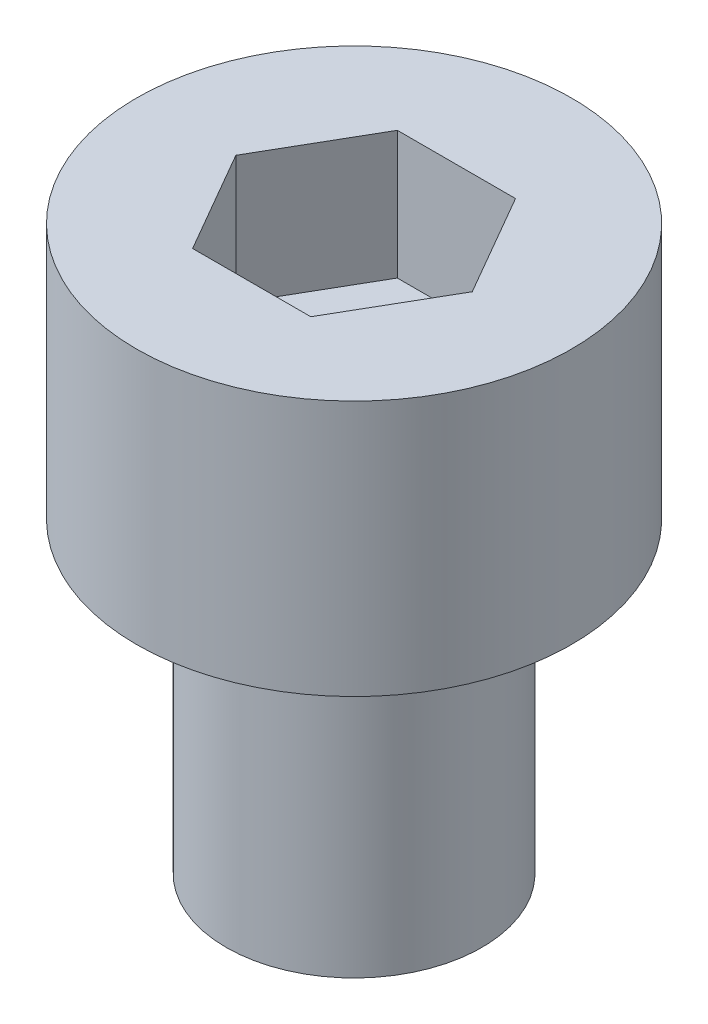
ISO-10303-21;
HEADER;
FILE_DESCRIPTION(('STEP AP214'),'2;1');
FILE_NAME('part.step','',(''),(''),'','','');
FILE_SCHEMA(('AUTOMOTIVE_DESIGN { 1 0 10303 214 1 1 1 1 }'));
ENDSEC;
DATA;
#1=APPLICATION_CONTEXT('core data for automotive mechanical design processes');
#2=APPLICATION_PROTOCOL_DEFINITION('international standard','automotive_design',2000,#1);
#3=PRODUCT_CONTEXT('',#1,'mechanical');
#4=PRODUCT('Part','Part','',(#3));
#5=PRODUCT_RELATED_PRODUCT_CATEGORY('part','',(#4));
#6=PRODUCT_DEFINITION_FORMATION('','',#4);
#7=PRODUCT_DEFINITION_CONTEXT('part definition',#1,'design');
#8=PRODUCT_DEFINITION('design','',#6,#7);
#9=PRODUCT_DEFINITION_SHAPE('','',#8);
#10=(LENGTH_UNIT() NAMED_UNIT(*) SI_UNIT(.MILLI.,.METRE.));
#11=(NAMED_UNIT(*) PLANE_ANGLE_UNIT() SI_UNIT($,.RADIAN.));
#12=(NAMED_UNIT(*) SI_UNIT($,.STERADIAN.) SOLID_ANGLE_UNIT());
#13=UNCERTAINTY_MEASURE_WITH_UNIT(LENGTH_MEASURE(1.E-05),#10,'distance_accuracy_value','');
#14=(GEOMETRIC_REPRESENTATION_CONTEXT(3) GLOBAL_UNCERTAINTY_ASSIGNED_CONTEXT((#13)) GLOBAL_UNIT_ASSIGNED_CONTEXT((#10,
#11,#12)) REPRESENTATION_CONTEXT('',''));
#15=CARTESIAN_POINT('',(0.,0.,0.));
#16=DIRECTION('',(0.,0.,1.));
#17=DIRECTION('',(1.,0.,0.));
#18=AXIS2_PLACEMENT_3D('',#15,#16,#17);
#19=CARTESIAN_POINT('',(0.,5.,0.));
#20=DIRECTION('',(0.,-1.,0.));
#21=DIRECTION('',(0.,0.,-1.));
#22=AXIS2_PLACEMENT_3D('',#19,#20,#21);
#23=CYLINDRICAL_SURFACE('',#22,4.25);
#24=CARTESIAN_POINT('',(0.,5.,0.));
#25=DIRECTION('',(0.,1.,0.));
#26=DIRECTION('',(0.,0.,1.));
#27=AXIS2_PLACEMENT_3D('',#24,#25,#26);
#28=CIRCLE('',#27,4.25);
#29=CARTESIAN_POINT('',(0.,5.,4.25));
#30=VERTEX_POINT('',#29);
#31=EDGE_CURVE('E43',#30,#30,#28,.T.);
#32=ORIENTED_EDGE('',*,*,#31,.F.);
#33=EDGE_LOOP('',(#32));
#34=FACE_BOUND('',#33,.T.);
#35=CARTESIAN_POINT('',(0.,0.,0.));
#36=DIRECTION('',(0.,1.,0.));
#37=DIRECTION('',(0.,0.,1.));
#38=AXIS2_PLACEMENT_3D('',#35,#36,#37);
#39=CIRCLE('',#38,4.25);
#40=CARTESIAN_POINT('',(0.,0.,4.25));
#41=VERTEX_POINT('',#40);
#42=EDGE_CURVE('E38',#41,#41,#39,.T.);
#43=ORIENTED_EDGE('',*,*,#42,.T.);
#44=EDGE_LOOP('',(#43));
#45=FACE_BOUND('',#44,.T.);
#46=ADVANCED_FACE('F35',(#34,#45),#23,.T.);
#47=CARTESIAN_POINT('',(0.,5.,0.));
#48=DIRECTION('',(0.,1.,0.));
#49=DIRECTION('',(0.,0.,1.));
#50=AXIS2_PLACEMENT_3D('',#47,#48,#49);
#51=PLANE('',#50);
#52=DIRECTION('',(0.5,0.,-0.866025403784439));
#53=VECTOR('',#52,1.);
#54=CARTESIAN_POINT('',(1.15470053837925,5.,2.));
#55=LINE('',#54,#53);
#56=CARTESIAN_POINT('',(1.15470053837925,5.,2.));
#57=VERTEX_POINT('',#56);
#58=CARTESIAN_POINT('',(2.3094010767585,5.,0.));
#59=VERTEX_POINT('',#58);
#60=EDGE_CURVE('E51',#57,#59,#55,.T.);
#61=ORIENTED_EDGE('',*,*,#60,.F.);
#62=DIRECTION('',(1.,0.,0.));
#63=VECTOR('',#62,1.);
#64=CARTESIAN_POINT('',(-1.15470053837925,5.,2.));
#65=LINE('',#64,#63);
#66=CARTESIAN_POINT('',(-1.15470053837925,5.,2.));
#67=VERTEX_POINT('',#66);
#68=EDGE_CURVE('E135',#67,#57,#65,.T.);
#69=ORIENTED_EDGE('',*,*,#68,.F.);
#70=DIRECTION('',(0.5,0.,0.866025403784438));
#71=VECTOR('',#70,1.);
#72=CARTESIAN_POINT('',(-2.3094010767585,5.,0.));
#73=LINE('',#72,#71);
#74=CARTESIAN_POINT('',(-2.3094010767585,5.,0.));
#75=VERTEX_POINT('',#74);
#76=EDGE_CURVE('E133',#75,#67,#73,.T.);
#77=ORIENTED_EDGE('',*,*,#76,.F.);
#78=DIRECTION('',(-0.5,0.,0.866025403784439));
#79=VECTOR('',#78,1.);
#80=CARTESIAN_POINT('',(-1.15470053837925,5.,-2.));
#81=LINE('',#80,#79);
#82=CARTESIAN_POINT('',(-1.15470053837925,5.,-2.));
#83=VERTEX_POINT('',#82);
#84=EDGE_CURVE('E99',#83,#75,#81,.T.);
#85=ORIENTED_EDGE('',*,*,#84,.F.);
#86=DIRECTION('',(-1.,0.,0.));
#87=VECTOR('',#86,1.);
#88=CARTESIAN_POINT('',(1.15470053837925,5.,-2.));
#89=LINE('',#88,#87);
#90=CARTESIAN_POINT('',(1.15470053837925,5.,-2.));
#91=VERTEX_POINT('',#90);
#92=EDGE_CURVE('E129',#91,#83,#89,.T.);
#93=ORIENTED_EDGE('',*,*,#92,.F.);
#94=DIRECTION('',(-0.5,0.,-0.866025403784438));
#95=VECTOR('',#94,1.);
#96=CARTESIAN_POINT('',(2.3094010767585,5.,0.));
#97=LINE('',#96,#95);
#98=EDGE_CURVE('E125',#59,#91,#97,.T.);
#99=ORIENTED_EDGE('',*,*,#98,.F.);
#100=EDGE_LOOP('',(#61,#69,#77,#85,#93,#99));
#101=FACE_BOUND('',#100,.T.);
#102=ORIENTED_EDGE('',*,*,#31,.T.);
#103=EDGE_LOOP('',(#102));
#104=FACE_BOUND('',#103,.T.);
#105=ADVANCED_FACE('F153',(#101,#104),#51,.T.);
#106=CARTESIAN_POINT('',(0.,0.,0.));
#107=DIRECTION('',(0.,1.,0.));
#108=DIRECTION('',(0.,0.,1.));
#109=AXIS2_PLACEMENT_3D('',#106,#107,#108);
#110=PLANE('',#109);
#111=CARTESIAN_POINT('',(0.,0.,0.));
#112=DIRECTION('',(0.,-1.,0.));
#113=DIRECTION('',(0.,0.,-1.));
#114=AXIS2_PLACEMENT_3D('',#111,#112,#113);
#115=CIRCLE('',#114,2.5);
#116=CARTESIAN_POINT('',(0.,0.,-2.5));
#117=VERTEX_POINT('',#116);
#118=EDGE_CURVE('E11',#117,#117,#115,.T.);
#119=ORIENTED_EDGE('',*,*,#118,.F.);
#120=EDGE_LOOP('',(#119));
#121=FACE_BOUND('',#120,.T.);
#122=ORIENTED_EDGE('',*,*,#42,.F.);
#123=EDGE_LOOP('',(#122));
#124=FACE_BOUND('',#123,.T.);
#125=ADVANCED_FACE('F150',(#121,#124),#110,.F.);
#126=CARTESIAN_POINT('',(1.15470053837925,2.5,2.));
#127=DIRECTION('',(0.866025403784439,0.,0.5));
#128=DIRECTION('',(0.5,0.,-0.866025403784439));
#129=AXIS2_PLACEMENT_3D('',#126,#127,#128);
#130=PLANE('',#129);
#131=ORIENTED_EDGE('',*,*,#60,.T.);
#132=DIRECTION('',(0.,1.,0.));
#133=VECTOR('',#132,1.);
#134=CARTESIAN_POINT('',(2.3094010767585,2.5,0.));
#135=LINE('',#134,#133);
#136=CARTESIAN_POINT('',(2.3094010767585,2.5,0.));
#137=VERTEX_POINT('',#136);
#138=EDGE_CURVE('E81',#137,#59,#135,.T.);
#139=ORIENTED_EDGE('',*,*,#138,.F.);
#140=DIRECTION('',(0.5,0.,-0.866025403784439));
#141=VECTOR('',#140,1.);
#142=CARTESIAN_POINT('',(1.15470053837925,2.5,2.));
#143=LINE('',#142,#141);
#144=CARTESIAN_POINT('',(1.15470053837925,2.5,2.));
#145=VERTEX_POINT('',#144);
#146=EDGE_CURVE('E137',#145,#137,#143,.T.);
#147=ORIENTED_EDGE('',*,*,#146,.F.);
#148=DIRECTION('',(0.,1.,0.));
#149=VECTOR('',#148,1.);
#150=CARTESIAN_POINT('',(1.15470053837925,2.5,2.));
#151=LINE('',#150,#149);
#152=EDGE_CURVE('E59',#145,#57,#151,.T.);
#153=ORIENTED_EDGE('',*,*,#152,.T.);
#154=EDGE_LOOP('',(#131,#139,#147,#153));
#155=FACE_BOUND('',#154,.T.);
#156=ADVANCED_FACE('F152',(#155),#130,.F.);
#157=CARTESIAN_POINT('',(-1.15470053837925,2.5,2.));
#158=DIRECTION('',(0.,0.,1.));
#159=DIRECTION('',(1.,0.,0.));
#160=AXIS2_PLACEMENT_3D('',#157,#158,#159);
#161=PLANE('',#160);
#162=ORIENTED_EDGE('',*,*,#68,.T.);
#163=ORIENTED_EDGE('',*,*,#152,.F.);
#164=DIRECTION('',(1.,0.,0.));
#165=VECTOR('',#164,1.);
#166=CARTESIAN_POINT('',(-1.15470053837925,2.5,2.));
#167=LINE('',#166,#165);
#168=CARTESIAN_POINT('',(-1.15470053837925,2.5,2.));
#169=VERTEX_POINT('',#168);
#170=EDGE_CURVE('E111',#169,#145,#167,.T.);
#171=ORIENTED_EDGE('',*,*,#170,.F.);
#172=DIRECTION('',(0.,1.,0.));
#173=VECTOR('',#172,1.);
#174=CARTESIAN_POINT('',(-1.15470053837925,2.5,2.));
#175=LINE('',#174,#173);
#176=EDGE_CURVE('E103',#169,#67,#175,.T.);
#177=ORIENTED_EDGE('',*,*,#176,.T.);
#178=EDGE_LOOP('',(#162,#163,#171,#177));
#179=FACE_BOUND('',#178,.T.);
#180=ADVANCED_FACE('F159',(#179),#161,.F.);
#181=CARTESIAN_POINT('',(-2.3094010767585,2.5,0.));
#182=DIRECTION('',(-0.866025403784439,0.,0.5));
#183=DIRECTION('',(0.5,0.,0.866025403784439));
#184=AXIS2_PLACEMENT_3D('',#181,#182,#183);
#185=PLANE('',#184);
#186=ORIENTED_EDGE('',*,*,#76,.T.);
#187=ORIENTED_EDGE('',*,*,#176,.F.);
#188=DIRECTION('',(0.5,0.,0.866025403784438));
#189=VECTOR('',#188,1.);
#190=CARTESIAN_POINT('',(-2.3094010767585,2.5,0.));
#191=LINE('',#190,#189);
#192=CARTESIAN_POINT('',(-2.3094010767585,2.5,0.));
#193=VERTEX_POINT('',#192);
#194=EDGE_CURVE('E107',#193,#169,#191,.T.);
#195=ORIENTED_EDGE('',*,*,#194,.F.);
#196=DIRECTION('',(0.,1.,0.));
#197=VECTOR('',#196,1.);
#198=CARTESIAN_POINT('',(-2.3094010767585,2.5,0.));
#199=LINE('',#198,#197);
#200=EDGE_CURVE('E92',#193,#75,#199,.T.);
#201=ORIENTED_EDGE('',*,*,#200,.T.);
#202=EDGE_LOOP('',(#186,#187,#195,#201));
#203=FACE_BOUND('',#202,.T.);
#204=ADVANCED_FACE('F108',(#203),#185,.F.);
#205=CARTESIAN_POINT('',(-1.15470053837925,2.5,-2.));
#206=DIRECTION('',(-0.866025403784439,0.,-0.5));
#207=DIRECTION('',(-0.5,0.,0.866025403784439));
#208=AXIS2_PLACEMENT_3D('',#205,#206,#207);
#209=PLANE('',#208);
#210=ORIENTED_EDGE('',*,*,#84,.T.);
#211=ORIENTED_EDGE('',*,*,#200,.F.);
#212=DIRECTION('',(-0.5,0.,0.866025403784439));
#213=VECTOR('',#212,1.);
#214=CARTESIAN_POINT('',(-1.15470053837925,2.5,-2.));
#215=LINE('',#214,#213);
#216=CARTESIAN_POINT('',(-1.15470053837925,2.5,-2.));
#217=VERTEX_POINT('',#216);
#218=EDGE_CURVE('E96',#217,#193,#215,.T.);
#219=ORIENTED_EDGE('',*,*,#218,.F.);
#220=DIRECTION('',(0.,1.,0.));
#221=VECTOR('',#220,1.);
#222=CARTESIAN_POINT('',(-1.15470053837925,2.5,-2.));
#223=LINE('',#222,#221);
#224=EDGE_CURVE('E104',#217,#83,#223,.T.);
#225=ORIENTED_EDGE('',*,*,#224,.T.);
#226=EDGE_LOOP('',(#210,#211,#219,#225));
#227=FACE_BOUND('',#226,.T.);
#228=ADVANCED_FACE('F94',(#227),#209,.F.);
#229=CARTESIAN_POINT('',(1.15470053837925,2.5,-2.));
#230=DIRECTION('',(0.,0.,-1.));
#231=DIRECTION('',(-1.,0.,0.));
#232=AXIS2_PLACEMENT_3D('',#229,#230,#231);
#233=PLANE('',#232);
#234=ORIENTED_EDGE('',*,*,#92,.T.);
#235=ORIENTED_EDGE('',*,*,#224,.F.);
#236=DIRECTION('',(-1.,0.,0.));
#237=VECTOR('',#236,1.);
#238=CARTESIAN_POINT('',(1.15470053837925,2.5,-2.));
#239=LINE('',#238,#237);
#240=CARTESIAN_POINT('',(1.15470053837925,2.5,-2.));
#241=VERTEX_POINT('',#240);
#242=EDGE_CURVE('E117',#241,#217,#239,.T.);
#243=ORIENTED_EDGE('',*,*,#242,.F.);
#244=DIRECTION('',(0.,1.,0.));
#245=VECTOR('',#244,1.);
#246=CARTESIAN_POINT('',(1.15470053837925,2.5,-2.));
#247=LINE('',#246,#245);
#248=EDGE_CURVE('E141',#241,#91,#247,.T.);
#249=ORIENTED_EDGE('',*,*,#248,.T.);
#250=EDGE_LOOP('',(#234,#235,#243,#249));
#251=FACE_BOUND('',#250,.T.);
#252=ADVANCED_FACE('F204',(#251),#233,.F.);
#253=CARTESIAN_POINT('',(2.3094010767585,2.5,0.));
#254=DIRECTION('',(0.866025403784438,0.,-0.5));
#255=DIRECTION('',(-0.5,0.,-0.866025403784439));
#256=AXIS2_PLACEMENT_3D('',#253,#254,#255);
#257=PLANE('',#256);
#258=ORIENTED_EDGE('',*,*,#98,.T.);
#259=ORIENTED_EDGE('',*,*,#248,.F.);
#260=DIRECTION('',(-0.5,0.,-0.866025403784438));
#261=VECTOR('',#260,1.);
#262=CARTESIAN_POINT('',(2.3094010767585,2.5,0.));
#263=LINE('',#262,#261);
#264=EDGE_CURVE('E119',#137,#241,#263,.T.);
#265=ORIENTED_EDGE('',*,*,#264,.F.);
#266=ORIENTED_EDGE('',*,*,#138,.T.);
#267=EDGE_LOOP('',(#258,#259,#265,#266));
#268=FACE_BOUND('',#267,.T.);
#269=ADVANCED_FACE('F213',(#268),#257,.F.);
#270=CARTESIAN_POINT('',(0.,2.5,0.));
#271=DIRECTION('',(0.,1.,0.));
#272=DIRECTION('',(0.,0.,1.));
#273=AXIS2_PLACEMENT_3D('',#270,#271,#272);
#274=PLANE('',#273);
#275=ORIENTED_EDGE('',*,*,#146,.T.);
#276=ORIENTED_EDGE('',*,*,#264,.T.);
#277=ORIENTED_EDGE('',*,*,#242,.T.);
#278=ORIENTED_EDGE('',*,*,#218,.T.);
#279=ORIENTED_EDGE('',*,*,#194,.T.);
#280=ORIENTED_EDGE('',*,*,#170,.T.);
#281=EDGE_LOOP('',(#275,#276,#277,#278,#279,#280));
#282=FACE_BOUND('',#281,.T.);
#283=ADVANCED_FACE('F114',(#282),#274,.T.);
#284=CARTESIAN_POINT('',(0.,-6.,0.));
#285=DIRECTION('',(0.,1.,0.));
#286=DIRECTION('',(0.,0.,1.));
#287=AXIS2_PLACEMENT_3D('',#284,#285,#286);
#288=CYLINDRICAL_SURFACE('',#287,2.5);
#289=CARTESIAN_POINT('',(0.,-6.,0.));
#290=DIRECTION('',(0.,-1.,0.));
#291=DIRECTION('',(0.,0.,-1.));
#292=AXIS2_PLACEMENT_3D('',#289,#290,#291);
#293=CIRCLE('',#292,2.5);
#294=CARTESIAN_POINT('',(0.,-6.,-2.5));
#295=VERTEX_POINT('',#294);
#296=EDGE_CURVE('E126',#295,#295,#293,.T.);
#297=ORIENTED_EDGE('',*,*,#296,.F.);
#298=EDGE_LOOP('',(#297));
#299=FACE_BOUND('',#298,.T.);
#300=ORIENTED_EDGE('',*,*,#118,.T.);
#301=EDGE_LOOP('',(#300));
#302=FACE_BOUND('',#301,.T.);
#303=ADVANCED_FACE('F231',(#299,#302),#288,.T.);
#304=CARTESIAN_POINT('',(0.,-6.,0.));
#305=DIRECTION('',(0.,-1.,0.));
#306=DIRECTION('',(0.,0.,-1.));
#307=AXIS2_PLACEMENT_3D('',#304,#305,#306);
#308=PLANE('',#307);
#309=ORIENTED_EDGE('',*,*,#296,.T.);
#310=EDGE_LOOP('',(#309));
#311=FACE_BOUND('',#310,.T.);
#312=ADVANCED_FACE('F244',(#311),#308,.T.);
#313=CLOSED_SHELL('',(#46,#105,#125,#156,#180,#204,#228,#252,#269,#283,#303,#312));
#314=MANIFOLD_SOLID_BREP('B2',#313);
#315=ADVANCED_BREP_SHAPE_REPRESENTATION('',(#18,#314),#14);
#316=SHAPE_DEFINITION_REPRESENTATION(#9,#315);
ENDSEC;
END-ISO-10303-21;
